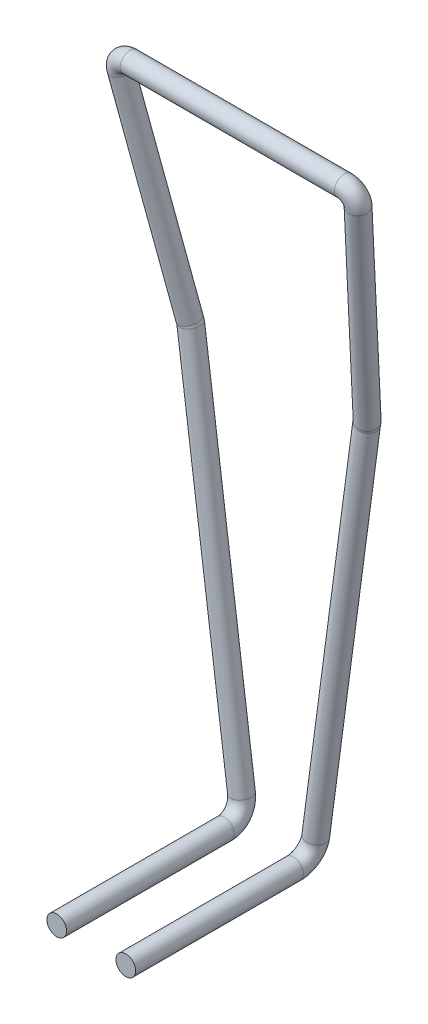
ISO-10303-21;
HEADER;
FILE_DESCRIPTION(('STEP AP214'),'2;1');
FILE_NAME('part.step','',(''),(''),'','','');
FILE_SCHEMA(('AUTOMOTIVE_DESIGN { 1 0 10303 214 1 1 1 1 }'));
ENDSEC;
DATA;
#1=APPLICATION_CONTEXT('core data for automotive mechanical design processes');
#2=APPLICATION_PROTOCOL_DEFINITION('international standard','automotive_design',2000,#1);
#3=PRODUCT_CONTEXT('',#1,'mechanical');
#4=PRODUCT('Part','Part','',(#3));
#5=PRODUCT_RELATED_PRODUCT_CATEGORY('part','',(#4));
#6=PRODUCT_DEFINITION_FORMATION('','',#4);
#7=PRODUCT_DEFINITION_CONTEXT('part definition',#1,'design');
#8=PRODUCT_DEFINITION('design','',#6,#7);
#9=PRODUCT_DEFINITION_SHAPE('','',#8);
#10=(LENGTH_UNIT() NAMED_UNIT(*) SI_UNIT(.MILLI.,.METRE.));
#11=(NAMED_UNIT(*) PLANE_ANGLE_UNIT() SI_UNIT($,.RADIAN.));
#12=(NAMED_UNIT(*) SI_UNIT($,.STERADIAN.) SOLID_ANGLE_UNIT());
#13=UNCERTAINTY_MEASURE_WITH_UNIT(LENGTH_MEASURE(1.E-05),#10,'distance_accuracy_value','');
#14=(GEOMETRIC_REPRESENTATION_CONTEXT(3) GLOBAL_UNCERTAINTY_ASSIGNED_CONTEXT((#13)) GLOBAL_UNIT_ASSIGNED_CONTEXT((#10,
#11,#12)) REPRESENTATION_CONTEXT('',''));
#15=CARTESIAN_POINT('',(0.,0.,0.));
#16=DIRECTION('',(0.,0.,1.));
#17=DIRECTION('',(1.,0.,0.));
#18=AXIS2_PLACEMENT_3D('',#15,#16,#17);
#19=CARTESIAN_POINT('',(0.350000000000152,-0.0999999999999992,0.100000000000001));
#20=DIRECTION('',(0.,0.,1.));
#21=DIRECTION('',(0.,-1.,0.));
#22=AXIS2_PLACEMENT_3D('',#19,#20,#21);
#23=CYLINDRICAL_SURFACE('',#22,0.1);
#24=CARTESIAN_POINT('',(0.350000000000152,-0.0999999999999992,0.100000000000001));
#25=DIRECTION('',(0.,0.,-1.));
#26=DIRECTION('',(-0.99127859616408,0.131782945736434,0.));
#27=AXIS2_PLACEMENT_3D('',#24,#25,#26);
#28=CIRCLE('',#27,0.1);
#29=CARTESIAN_POINT('',(0.336821705426508,-0.199127859616407,0.100000000000001));
#30=VERTEX_POINT('',#29);
#31=EDGE_CURVE('E99',#30,#30,#28,.T.);
#32=ORIENTED_EDGE('',*,*,#31,.F.);
#33=EDGE_LOOP('',(#32));
#34=FACE_BOUND('',#33,.T.);
#35=CARTESIAN_POINT('',(0.350000000000152,-0.0999999999999992,1.8));
#36=DIRECTION('',(0.,0.,-1.));
#37=DIRECTION('',(-0.99127859616408,0.131782945736434,0.));
#38=AXIS2_PLACEMENT_3D('',#35,#36,#37);
#39=CIRCLE('',#38,0.1);
#40=CARTESIAN_POINT('',(0.250872140383743,-0.0868217054263558,1.8));
#41=VERTEX_POINT('',#40);
#42=EDGE_CURVE('E12',#41,#41,#39,.T.);
#43=ORIENTED_EDGE('',*,*,#42,.T.);
#44=EDGE_LOOP('',(#43));
#45=FACE_BOUND('',#44,.T.);
#46=ADVANCED_FACE('F93',(#34,#45),#23,.T.);
#47=CARTESIAN_POINT('',(0.37624165591859,0.097391185137691,0.0999999999999995));
#48=DIRECTION('',(-0.99127859616408,0.131782945736434,0.));
#49=DIRECTION('',(-0.131782945736434,-0.99127859616408,0.));
#50=AXIS2_PLACEMENT_3D('',#47,#48,#49);
#51=TOROIDAL_SURFACE('',#50,0.199127859616387,0.1);
#52=CARTESIAN_POINT('',(0.37624165591859,0.0973911851376908,-0.0991278596163876));
#53=DIRECTION('',(0.131782945736436,0.991278596164079,0.));
#54=DIRECTION('',(-0.991278596164079,0.131782945736436,0.));
#55=AXIS2_PLACEMENT_3D('',#52,#53,#54);
#56=CIRCLE('',#55,0.1);
#57=CARTESIAN_POINT('',(0.37624165591859,0.0973911851376907,-0.199127859616388));
#58=VERTEX_POINT('',#57);
#59=EDGE_CURVE('E151',#58,#58,#56,.T.);
#60=CARTESIAN_POINT('',(0.37624165591859,0.097391185137691,0.0999999999999995));
#61=DIRECTION('',(-0.99127859616408,0.131782945736434,0.));
#62=DIRECTION('',(-0.131782945736434,-0.99127859616408,0.));
#63=AXIS2_PLACEMENT_3D('',#60,#61,#62);
#64=CIRCLE('',#63,0.299127859616387);
#65=EDGE_CURVE('',#58,#30,#64,.T.);
#66=ORIENTED_EDGE('',*,*,#59,.F.);
#67=ORIENTED_EDGE('',*,*,#31,.T.);
#68=ORIENTED_EDGE('',*,*,#65,.T.);
#69=ORIENTED_EDGE('',*,*,#65,.F.);
#70=EDGE_LOOP('',(#66,#68,#67,#69));
#71=FACE_BOUND('',#70,.T.);
#72=ADVANCED_FACE('F160',(#71),#51,.T.);
#73=CARTESIAN_POINT('',(1.20240864931992,6.24335833757032,0.298245940234091));
#74=DIRECTION('',(-0.131782945736434,-0.976218846897443,-0.172133721784126));
#75=DIRECTION('',(0.,0.173648177666931,-0.984807753012208));
#76=AXIS2_PLACEMENT_3D('',#73,#74,#75);
#77=CYLINDRICAL_SURFACE('',#76,0.1);
#78=CARTESIAN_POINT('',(1.20240864931992,6.24335833757032,0.298245940234091));
#79=DIRECTION('',(-0.131782945736443,-0.976218846897443,-0.172133721784116));
#80=DIRECTION('',(0.,-0.173648177666921,0.98480775301221));
#81=AXIS2_PLACEMENT_3D('',#78,#79,#80);
#82=CIRCLE('',#81,0.1);
#83=CARTESIAN_POINT('',(1.30153650893633,6.23038025090272,0.29595755339662));
#84=VERTEX_POINT('',#83);
#85=EDGE_CURVE('E103',#84,#84,#82,.T.);
#86=ORIENTED_EDGE('',*,*,#85,.T.);
#87=EDGE_LOOP('',(#86));
#88=FACE_BOUND('',#87,.T.);
#89=CARTESIAN_POINT('',(0.998853683453174,3.98818110698593,-0.0994496955048382));
#90=CARTESIAN_POINT('',(0.998761833545385,4.02292276402977,-0.296409104595756));
#91=CARTESIAN_POINT('',(0.802184878507584,4.06129860006108,-0.28954832188118));
#92=CARTESIAN_POINT('',(0.802276728415373,4.02655694301725,-0.0925889127902628));
#93=CARTESIAN_POINT('',(0.802368578323163,3.99181528597342,0.104370496300655));
#94=CARTESIAN_POINT('',(0.998945533360963,3.9534394499421,0.0975097135860795));
#95=CARTESIAN_POINT('',(0.998853683453174,3.98818110698593,-0.0994496955048382));
#96=(BOUNDED_CURVE() B_SPLINE_CURVE(3,(#89,#90,#91,#92,#93,#94,#95),.UNSPECIFIED.,.T.,
.F.) B_SPLINE_CURVE_WITH_KNOTS((4,3,4),(0.,0.5,1.),
.UNSPECIFIED.) CURVE() GEOMETRIC_REPRESENTATION_ITEM() RATIONAL_B_SPLINE_CURVE((1.,
0.333333333333333,0.333333333333333,1.,0.333333333333333,0.333333333333333,1.)) REPRESENTATION_ITEM(''));
#97=CARTESIAN_POINT('',(0.998853683453174,3.98818110698593,-0.0994496955048382));
#98=VERTEX_POINT('',#97);
#99=EDGE_CURVE('E143',#98,#98,#96,.T.);
#100=ORIENTED_EDGE('',*,*,#99,.T.);
#101=EDGE_LOOP('',(#100));
#102=FACE_BOUND('',#101,.T.);
#103=ADVANCED_FACE('F162',(#88,#102),#77,.T.);
#104=CARTESIAN_POINT('',(1.0858259474061,6.25862165925643,0.300937275662585));
#105=DIRECTION('',(0.,0.173648177666927,-0.984807753012209));
#106=DIRECTION('',(0.,0.984807753012209,0.173648177666927));
#107=AXIS2_PLACEMENT_3D('',#104,#105,#106);
#108=TOROIDAL_SURFACE('',#107,0.117608412372625,0.1);
#109=CARTESIAN_POINT('',(1.0858259474061,6.37444333558045,0.321359762149392));
#110=DIRECTION('',(1.,0.,0.));
#111=DIRECTION('',(0.,-0.173648177666926,0.984807753012209));
#112=AXIS2_PLACEMENT_3D('',#109,#110,#111);
#113=CIRCLE('',#112,0.1);
#114=CARTESIAN_POINT('',(1.0858259474061,6.47292411088167,0.338724579916085));
#115=VERTEX_POINT('',#114);
#116=EDGE_CURVE('E107',#115,#115,#113,.T.);
#117=CARTESIAN_POINT('',(1.0858259474061,6.25862165925643,0.300937275662585));
#118=DIRECTION('',(0.,0.173648177666927,-0.984807753012209));
#119=DIRECTION('',(0.,0.984807753012209,0.173648177666927));
#120=AXIS2_PLACEMENT_3D('',#117,#118,#119);
#121=CIRCLE('',#120,0.217608412372625);
#122=EDGE_CURVE('',#115,#84,#121,.T.);
#123=ORIENTED_EDGE('',*,*,#116,.T.);
#124=ORIENTED_EDGE('',*,*,#85,.F.);
#125=ORIENTED_EDGE('',*,*,#122,.T.);
#126=ORIENTED_EDGE('',*,*,#122,.F.);
#127=EDGE_LOOP('',(#123,#125,#124,#126));
#128=FACE_BOUND('',#127,.T.);
#129=ADVANCED_FACE('F167',(#128),#108,.T.);
#130=CARTESIAN_POINT('',(-1.0858259474061,6.37444333558045,0.321359762149392));
#131=DIRECTION('',(1.,0.,0.));
#132=DIRECTION('',(0.,1.,0.));
#133=AXIS2_PLACEMENT_3D('',#130,#131,#132);
#134=CYLINDRICAL_SURFACE('',#133,0.1);
#135=CARTESIAN_POINT('',(-1.0858259474061,6.37444333558045,0.321359762149392));
#136=DIRECTION('',(1.,0.,0.));
#137=DIRECTION('',(0.,-0.173648177666926,0.984807753012209));
#138=AXIS2_PLACEMENT_3D('',#135,#136,#137);
#139=CIRCLE('',#138,0.1);
#140=CARTESIAN_POINT('',(-1.0858259474061,6.47292411088168,0.338724579916085));
#141=VERTEX_POINT('',#140);
#142=EDGE_CURVE('E112',#141,#141,#139,.T.);
#143=ORIENTED_EDGE('',*,*,#142,.T.);
#144=EDGE_LOOP('',(#143));
#145=FACE_BOUND('',#144,.T.);
#146=ORIENTED_EDGE('',*,*,#116,.F.);
#147=EDGE_LOOP('',(#146));
#148=FACE_BOUND('',#147,.T.);
#149=ADVANCED_FACE('F174',(#145,#148),#134,.T.);
#150=CARTESIAN_POINT('',(-1.0858259474061,6.25862165925644,0.300937275662585));
#151=DIRECTION('',(0.,0.173648177666927,-0.984807753012209));
#152=DIRECTION('',(0.,0.984807753012209,0.173648177666927));
#153=AXIS2_PLACEMENT_3D('',#150,#151,#152);
#154=TOROIDAL_SURFACE('',#153,0.117608412372625,0.1);
#155=CARTESIAN_POINT('',(-1.20240864931992,6.24335833757033,0.298245940234091));
#156=DIRECTION('',(-0.131782945736431,0.976218846897443,0.172133721784128));
#157=DIRECTION('',(0.,-0.173648177666933,0.984807753012208));
#158=AXIS2_PLACEMENT_3D('',#155,#156,#157);
#159=CIRCLE('',#158,0.1);
#160=CARTESIAN_POINT('',(-1.30153650893633,6.23038025090272,0.29595755339662));
#161=VERTEX_POINT('',#160);
#162=EDGE_CURVE('E125',#161,#161,#159,.T.);
#163=CARTESIAN_POINT('',(-1.0858259474061,6.25862165925644,0.300937275662585));
#164=DIRECTION('',(0.,0.173648177666927,-0.984807753012209));
#165=DIRECTION('',(0.,0.984807753012209,0.173648177666927));
#166=AXIS2_PLACEMENT_3D('',#163,#164,#165);
#167=CIRCLE('',#166,0.217608412372625);
#168=EDGE_CURVE('',#161,#141,#167,.T.);
#169=ORIENTED_EDGE('',*,*,#162,.T.);
#170=ORIENTED_EDGE('',*,*,#142,.F.);
#171=ORIENTED_EDGE('',*,*,#168,.T.);
#172=ORIENTED_EDGE('',*,*,#168,.F.);
#173=EDGE_LOOP('',(#169,#171,#170,#172));
#174=FACE_BOUND('',#173,.T.);
#175=ADVANCED_FACE('F178',(#174),#154,.T.);
#176=CARTESIAN_POINT('',(-0.376241655918441,0.0973911851377086,-0.0991278596164078));
#177=DIRECTION('',(-0.131782945736434,0.991278596164079,0.));
#178=DIRECTION('',(-0.991278596164079,-0.131782945736434,0.));
#179=AXIS2_PLACEMENT_3D('',#176,#177,#178);
#180=CYLINDRICAL_SURFACE('',#179,0.1);
#181=CARTESIAN_POINT('',(-0.376241655918441,0.0973911851377086,-0.0991278596164078));
#182=DIRECTION('',(0.131782945736434,-0.99127859616408,0.));
#183=DIRECTION('',(0.982633255213028,0.130633613447978,-0.131782945736434));
#184=AXIS2_PLACEMENT_3D('',#181,#182,#183);
#185=CIRCLE('',#184,0.1);
#186=CARTESIAN_POINT('',(-0.376241655918441,0.0973911851377076,-0.199127859616408));
#187=VERTEX_POINT('',#186);
#188=EDGE_CURVE('E118',#187,#187,#185,.T.);
#189=ORIENTED_EDGE('',*,*,#188,.F.);
#190=EDGE_LOOP('',(#189));
#191=FACE_BOUND('',#190,.T.);
#192=CARTESIAN_POINT('',(-0.891571113557251,3.97372782699625,-0.0991278596164079));
#193=DIRECTION('',(-0.194526739257409,0.980897215230344,2.94488834351061E-05));
#194=DIRECTION('',(0.980897108163614,0.194526731905408,-0.000462353176904689));
#195=AXIS2_PLACEMENT_3D('',#192,#193,#194);
#196=ELLIPSE('',#195,0.100202637667993,0.1);
#197=CARTESIAN_POINT('',(-0.79328263603835,3.99321991863011,-0.0991741886242679));
#198=VERTEX_POINT('',#197);
#199=EDGE_CURVE('E115',#198,#198,#196,.T.);
#200=ORIENTED_EDGE('',*,*,#199,.F.);
#201=EDGE_LOOP('',(#200));
#202=FACE_BOUND('',#201,.T.);
#203=ADVANCED_FACE('F182',(#191,#202),#180,.T.);
#204=CARTESIAN_POINT('',(-0.376241655918441,0.0973911851377108,0.1));
#205=DIRECTION('',(0.99127859616408,0.131782945736434,0.));
#206=DIRECTION('',(-0.131782945736434,0.99127859616408,0.));
#207=AXIS2_PLACEMENT_3D('',#204,#205,#206);
#208=TOROIDAL_SURFACE('',#207,0.199127859616408,0.1);
#209=CARTESIAN_POINT('',(-0.35,-0.0999999999999998,0.1));
#210=DIRECTION('',(0.,0.,1.));
#211=DIRECTION('',(1.,0.,0.));
#212=AXIS2_PLACEMENT_3D('',#209,#210,#211);
#213=CIRCLE('',#212,0.1);
#214=CARTESIAN_POINT('',(-0.336821705426357,-0.199127859616408,0.1));
#215=VERTEX_POINT('',#214);
#216=EDGE_CURVE('E121',#215,#215,#213,.T.);
#217=CARTESIAN_POINT('',(-0.376241655918441,0.0973911851377108,0.1));
#218=DIRECTION('',(0.99127859616408,0.131782945736434,0.));
#219=DIRECTION('',(-0.131782945736434,0.99127859616408,0.));
#220=AXIS2_PLACEMENT_3D('',#217,#218,#219);
#221=CIRCLE('',#220,0.299127859616408);
#222=EDGE_CURVE('',#215,#187,#221,.T.);
#223=ORIENTED_EDGE('',*,*,#216,.F.);
#224=ORIENTED_EDGE('',*,*,#188,.T.);
#225=ORIENTED_EDGE('',*,*,#222,.T.);
#226=ORIENTED_EDGE('',*,*,#222,.F.);
#227=EDGE_LOOP('',(#223,#225,#224,#226));
#228=FACE_BOUND('',#227,.T.);
#229=ADVANCED_FACE('F186',(#228),#208,.T.);
#230=CARTESIAN_POINT('',(-0.35,-0.0999999999999998,0.1));
#231=DIRECTION('',(0.,0.,1.));
#232=DIRECTION('',(0.,-1.,0.));
#233=AXIS2_PLACEMENT_3D('',#230,#231,#232);
#234=CYLINDRICAL_SURFACE('',#233,0.1);
#235=ORIENTED_EDGE('',*,*,#216,.T.);
#236=EDGE_LOOP('',(#235));
#237=FACE_BOUND('',#236,.T.);
#238=CARTESIAN_POINT('',(-0.35,-0.1,1.8));
#239=DIRECTION('',(0.,0.,1.));
#240=DIRECTION('',(1.,0.,0.));
#241=AXIS2_PLACEMENT_3D('',#238,#239,#240);
#242=CIRCLE('',#241,0.1);
#243=CARTESIAN_POINT('',(-0.25,-0.1,1.8));
#244=VERTEX_POINT('',#243);
#245=EDGE_CURVE('E122',#244,#244,#242,.T.);
#246=ORIENTED_EDGE('',*,*,#245,.F.);
#247=EDGE_LOOP('',(#246));
#248=FACE_BOUND('',#247,.T.);
#249=ADVANCED_FACE('F190',(#237,#248),#234,.T.);
#250=CARTESIAN_POINT('',(-0.35,-0.1,1.8));
#251=DIRECTION('',(0.,0.,1.));
#252=DIRECTION('',(1.,0.,0.));
#253=AXIS2_PLACEMENT_3D('',#250,#251,#252);
#254=PLANE('',#253);
#255=ORIENTED_EDGE('',*,*,#245,.T.);
#256=EDGE_LOOP('',(#255));
#257=FACE_BOUND('',#256,.T.);
#258=ADVANCED_FACE('F194',(#257),#254,.T.);
#259=CARTESIAN_POINT('',(-0.793282636038349,3.9932199186301,-0.0991741886242679));
#260=CARTESIAN_POINT('',(-0.794948564272785,3.99947101103212,-0.0988418047525957));
#261=CARTESIAN_POINT('',(-0.7980101730222,4.01106235800287,-0.0993206987485209));
#262=CARTESIAN_POINT('',(-0.801049718369058,4.02235544232636,-0.0978038724099919));
#263=CARTESIAN_POINT('',(-0.802375980939512,4.02731999103552,-0.0971000125676045));
#264=CARTESIAN_POINT('',(-0.793374485946095,3.99320770788384,-0.299174167160497));
#265=CARTESIAN_POINT('',(-0.794993691652819,3.99923489514231,-0.298251211246527));
#266=CARTESIAN_POINT('',(-0.802487882393619,4.02757086013121,-0.299270640378896));
#267=CARTESIAN_POINT('',(-0.810002440721565,4.05553876922169,-0.295315012521435));
#268=CARTESIAN_POINT('',(-0.811277746622648,4.06027019487814,-0.294166959416065));
#269=CARTESIAN_POINT('',(-0.989951440983896,3.95422352461613,-0.299081509144777));
#270=CARTESIAN_POINT('',(-0.99157064669062,3.9602507118746,-0.298158553230807));
#271=CARTESIAN_POINT('',(-0.998990099591712,3.98821766296417,-0.298099299472849));
#272=CARTESIAN_POINT('',(-1.00638145985243,4.01564105322673,-0.293152852273927));
#273=CARTESIAN_POINT('',(-1.00765676575351,4.02037247888317,-0.292004799168557));
#274=CARTESIAN_POINT('',(-0.98985959107615,3.95423573536239,-0.0990815306085479));
#275=CARTESIAN_POINT('',(-0.99150215804673,3.96037487519263,-0.0984538607157266));
#276=CARTESIAN_POINT('',(-0.994505423256666,3.97167928723967,-0.0981247271416645));
#277=CARTESIAN_POINT('',(-0.997454215834608,3.98257428785775,-0.0958638087939746));
#278=CARTESIAN_POINT('',(-0.998755000070377,3.98742227504055,-0.0949378523200959));
#279=CARTESIAN_POINT('',(-0.989767741168404,3.95424794610865,0.100918447927681));
#280=CARTESIAN_POINT('',(-0.99143366940284,3.96049903851067,0.101250831799354));
#281=CARTESIAN_POINT('',(-0.990020746921619,3.95514091151517,0.101849845189521));
#282=CARTESIAN_POINT('',(-0.988526971816787,3.94950752248878,0.101425234685978));
#283=CARTESIAN_POINT('',(-0.989853234387241,3.95447207119793,0.102129094528365));
#284=CARTESIAN_POINT('',(-0.793190786130602,3.99323212937636,0.100825789911961));
#285=CARTESIAN_POINT('',(-0.794903436892752,3.99970712692193,0.100567601741336));
#286=CARTESIAN_POINT('',(-0.793532463650782,3.99455385587454,0.100629242881853));
#287=CARTESIAN_POINT('',(-0.792096996016553,3.98917211543103,0.0997072677014521));
#288=CARTESIAN_POINT('',(-0.793474215256376,3.9943697871929,0.0999669342808566));
#289=CARTESIAN_POINT('',(-0.793282636038349,3.9932199186301,-0.0991741886242679));
#290=CARTESIAN_POINT('',(-0.794948564272785,3.99947101103212,-0.0988418047525957));
#291=CARTESIAN_POINT('',(-0.7980101730222,4.01106235800287,-0.0993206987485209));
#292=CARTESIAN_POINT('',(-0.801049718369058,4.02235544232636,-0.0978038724099919));
#293=CARTESIAN_POINT('',(-0.802375980939512,4.02731999103552,-0.0971000125676045));
#294=(BOUNDED_SURFACE() B_SPLINE_SURFACE(3,3,((#259,#260,#261,#262,#263),(#264,#265,#266,#267,
#268),(#269,#270,#271,#272,#273),(#274,#275,#276,#277,#278),(#279,#280,#281,#282,#283),(#284,
#285,#286,#287,#288),(#289,#290,#291,#292,#293)),.UNSPECIFIED.,.T.,.F.,
.F.) B_SPLINE_SURFACE_WITH_KNOTS((4,3,4),(4,1,4),(0.,0.5,1.),(0.,0.559331190816291,1.),
.UNSPECIFIED.) GEOMETRIC_REPRESENTATION_ITEM() RATIONAL_B_SPLINE_SURFACE(((1.,1.,1.,1.,1.),
(0.333333333333333,0.333333333333333,0.333333333333333,0.333333333333333,0.333333333333333),
(0.333333333333333,0.333333333333333,0.333333333333333,0.333333333333333,0.333333333333333),(1.,
1.,1.,1.,1.),(0.333333333333333,0.333333333333333,0.333333333333333,0.333333333333333,
0.333333333333333),(0.333333333333333,0.333333333333333,0.333333333333333,0.333333333333333,
0.333333333333333),(1.,1.,1.,1.,1.))) REPRESENTATION_ITEM('') SURFACE());
#295=CARTESIAN_POINT('',(-0.802375980939511,4.02731999103551,-0.0971000125676054));
#296=CARTESIAN_POINT('',(-0.793474215256375,3.99436978719289,0.0999669342808556));
#297=CARTESIAN_POINT('',(-0.98985323438724,3.95447207119792,0.102129094528364));
#298=CARTESIAN_POINT('',(-0.998755000070376,3.98742227504054,-0.0949378523200966));
#299=CARTESIAN_POINT('',(-1.00765676575351,4.02037247888316,-0.292004799168558));
#300=CARTESIAN_POINT('',(-0.811277746622648,4.06027019487813,-0.294166959416066));
#301=CARTESIAN_POINT('',(-0.802375980939511,4.02731999103551,-0.0971000125676054));
#302=(BOUNDED_CURVE() B_SPLINE_CURVE(3,(#295,#296,#297,#298,#299,#300,#301),.UNSPECIFIED.,.T.,
.F.) B_SPLINE_CURVE_WITH_KNOTS((4,3,4),(0.,0.5,1.),
.UNSPECIFIED.) CURVE() GEOMETRIC_REPRESENTATION_ITEM() RATIONAL_B_SPLINE_CURVE((1.,
0.333333333333333,0.333333333333333,1.,0.333333333333333,0.333333333333333,1.)) REPRESENTATION_ITEM(''));
#303=CARTESIAN_POINT('',(-0.802375980939511,4.02731999103551,-0.0971000125676054));
#304=VERTEX_POINT('',#303);
#305=EDGE_CURVE('E130',#304,#304,#302,.T.);
#306=ORIENTED_EDGE('',*,*,#199,.T.);
#307=EDGE_LOOP('',(#306));
#308=FACE_BOUND('',#307,.T.);
#309=ORIENTED_EDGE('',*,*,#305,.T.);
#310=EDGE_LOOP('',(#309));
#311=FACE_BOUND('',#310,.T.);
#312=ADVANCED_FACE('F198',(#308,#311),#294,.T.);
#313=CARTESIAN_POINT('',(-0.802375980939511,4.02731999103551,-0.0971000125676054));
#314=CARTESIAN_POINT('',(-1.10338249490243,6.25710951598056,0.296072041981318));
#315=CARTESIAN_POINT('',(-0.793474215256375,3.99436978719289,0.0999669342808556));
#316=CARTESIAN_POINT('',(-1.0944040109739,6.22359100038382,0.493038780134074));
#317=CARTESIAN_POINT('',(-0.98985323438724,3.95447207119792,0.102129094528364));
#318=CARTESIAN_POINT('',(-1.29245631980888,6.19608864356335,0.49738657663962));
#319=CARTESIAN_POINT('',(-0.998755000070376,3.98742227504054,-0.0949378523200966));
#320=CARTESIAN_POINT('',(-1.30143480373741,6.22960715916009,0.300419838486864));
#321=CARTESIAN_POINT('',(-1.00765676575351,4.02037247888316,-0.292004799168558));
#322=CARTESIAN_POINT('',(-1.31041328766594,6.26312567475684,0.103453100334109));
#323=CARTESIAN_POINT('',(-0.811277746622648,4.06027019487813,-0.294166959416066));
#324=CARTESIAN_POINT('',(-1.11236097883096,6.2906280315773,0.099105303828563));
#325=CARTESIAN_POINT('',(-0.802375980939511,4.02731999103551,-0.0971000125676054));
#326=CARTESIAN_POINT('',(-1.10338249490243,6.25710951598056,0.296072041981318));
#327=(BOUNDED_SURFACE() B_SPLINE_SURFACE(3,1,((#313,#314),(#315,#316),(#317,#318),(#319,#320),
(#321,#322),(#323,#324),(#325,#326)),.UNSPECIFIED.,.T.,.F.,.F.) B_SPLINE_SURFACE_WITH_KNOTS((4,
3,4),(2,2),(0.,0.5,1.),(0.,1.),
.UNSPECIFIED.) GEOMETRIC_REPRESENTATION_ITEM() RATIONAL_B_SPLINE_SURFACE(((1.,1.),
(0.333333333333333,0.333333333333333),(0.333333333333333,0.333333333333333),(1.,1.),
(0.333333333333333,0.333333333333333),(0.333333333333333,0.333333333333333),(1.,1.))) REPRESENTATION_ITEM('') SURFACE());
#328=ORIENTED_EDGE('',*,*,#305,.F.);
#329=EDGE_LOOP('',(#328));
#330=FACE_BOUND('',#329,.T.);
#331=ORIENTED_EDGE('',*,*,#162,.F.);
#332=EDGE_LOOP('',(#331));
#333=FACE_BOUND('',#332,.T.);
#334=ADVANCED_FACE('F204',(#330,#333),#327,.F.);
#335=CARTESIAN_POINT('',(0.998853683453174,3.98818110698593,-0.0994496955048382));
#336=CARTESIAN_POINT('',(0.997188656376083,3.98197639740456,-0.100268843923116));
#337=CARTESIAN_POINT('',(0.994129276427596,3.97066273586454,-0.102862275115137));
#338=CARTESIAN_POINT('',(0.991087792037484,3.95928140856322,-0.103439283938307));
#339=CARTESIAN_POINT('',(0.989760907693509,3.95427190512628,-0.103656598541557));
#340=CARTESIAN_POINT('',(0.998761833545385,4.02292276402977,-0.296409104595756));
#341=CARTESIAN_POINT('',(0.997143528996004,4.01683600621076,-0.296607772367925));
#342=CARTESIAN_POINT('',(0.989651396636137,3.98912534133554,-0.302641267692259));
#343=CARTESIAN_POINT('',(0.982135069685238,3.96089966051517,-0.303712010270504));
#344=CARTESIAN_POINT('',(0.980859142010629,3.9560426051173,-0.303451398511403));
#345=CARTESIAN_POINT('',(0.802184878507584,4.06129860006108,-0.28954832188118));
#346=CARTESIAN_POINT('',(0.800566573958203,4.05521184224207,-0.28974698965335));
#347=CARTESIAN_POINT('',(0.793149183332754,4.02767728455535,-0.294654069236737));
#348=CARTESIAN_POINT('',(0.785756050554361,3.99981578536769,-0.294654532420164));
#349=CARTESIAN_POINT('',(0.784480122879752,3.99495872996982,-0.294393920661063));
#350=CARTESIAN_POINT('',(0.802276728415373,4.02655694301725,-0.0925889127902628));
#351=CARTESIAN_POINT('',(0.800635062602137,4.02041120931706,-0.0930978208854866));
#352=CARTESIAN_POINT('',(0.797634029117554,4.00923981901877,-0.0948456431323064));
#353=CARTESIAN_POINT('',(0.794683294571924,3.9981213093962,-0.0946207692691427));
#354=CARTESIAN_POINT('',(0.793381888562632,3.9931880299788,-0.0945991206912171));
#355=CARTESIAN_POINT('',(0.802368578323163,3.99181528597342,0.104370496300655));
#356=CARTESIAN_POINT('',(0.800703551246072,3.98561057639204,0.103551347882377));
#357=CARTESIAN_POINT('',(0.802118874902354,3.99080235348219,0.104962782972125));
#358=CARTESIAN_POINT('',(0.803610538589487,3.99642683342472,0.105412993881879));
#359=CARTESIAN_POINT('',(0.802283654245513,3.99141732998777,0.105195679278629));
#360=CARTESIAN_POINT('',(0.998945533360963,3.9534394499421,0.0975097135860795));
#361=CARTESIAN_POINT('',(0.997233783756162,3.94711678859836,0.0960700845216924));
#362=CARTESIAN_POINT('',(0.998607156219055,3.95220013039355,0.0969167174619846));
#363=CARTESIAN_POINT('',(1.00004051438973,3.95766315661128,0.0968334423938908));
#364=CARTESIAN_POINT('',(0.998662673376389,3.95250120513525,0.0961382014282892));
#365=CARTESIAN_POINT('',(0.998853683453174,3.98818110698593,-0.0994496955048382));
#366=CARTESIAN_POINT('',(0.997188656376083,3.98197639740456,-0.100268843923116));
#367=CARTESIAN_POINT('',(0.994129276427596,3.97066273586454,-0.102862275115137));
#368=CARTESIAN_POINT('',(0.991087792037484,3.95928140856322,-0.103439283938307));
#369=CARTESIAN_POINT('',(0.989760907693509,3.95427190512628,-0.103656598541557));
#370=(BOUNDED_SURFACE() B_SPLINE_SURFACE(3,3,((#335,#336,#337,#338,#339),(#340,#341,#342,#343,
#344),(#345,#346,#347,#348,#349),(#350,#351,#352,#353,#354),(#355,#356,#357,#358,#359),(#360,
#361,#362,#363,#364),(#365,#366,#367,#368,#369)),.UNSPECIFIED.,.T.,.F.,
.F.) B_SPLINE_SURFACE_WITH_KNOTS((4,3,4),(4,1,4),(0.,0.5,1.),(0.,0.559321764812687,1.),
.UNSPECIFIED.) GEOMETRIC_REPRESENTATION_ITEM() RATIONAL_B_SPLINE_SURFACE(((1.,1.,1.,1.,1.),
(0.333333333333333,0.333333333333333,0.333333333333333,0.333333333333333,0.333333333333333),
(0.333333333333333,0.333333333333333,0.333333333333333,0.333333333333333,0.333333333333333),(1.,
1.,1.,1.,1.),(0.333333333333333,0.333333333333333,0.333333333333333,0.333333333333333,
0.333333333333333),(0.333333333333333,0.333333333333333,0.333333333333333,0.333333333333333,
0.333333333333333),(1.,1.,1.,1.,1.))) REPRESENTATION_ITEM('') SURFACE());
#371=CARTESIAN_POINT('',(0.989760907693509,3.95427190512628,-0.103656598541557));
#372=CARTESIAN_POINT('',(0.980859142010629,3.9560426051173,-0.303451398511403));
#373=CARTESIAN_POINT('',(0.784480122879752,3.99495872996982,-0.294393920661063));
#374=CARTESIAN_POINT('',(0.793381888562632,3.9931880299788,-0.0945991206912171));
#375=CARTESIAN_POINT('',(0.802283654245513,3.99141732998777,0.105195679278629));
#376=CARTESIAN_POINT('',(0.998662673376389,3.95250120513525,0.0961382014282892));
#377=CARTESIAN_POINT('',(0.989760907693509,3.95427190512628,-0.103656598541557));
#378=(BOUNDED_CURVE() B_SPLINE_CURVE(3,(#371,#372,#373,#374,#375,#376,#377),.UNSPECIFIED.,.T.,
.F.) B_SPLINE_CURVE_WITH_KNOTS((4,3,4),(0.,0.5,1.),
.UNSPECIFIED.) CURVE() GEOMETRIC_REPRESENTATION_ITEM() RATIONAL_B_SPLINE_CURVE((1.,
0.333333333333333,0.333333333333333,1.,0.333333333333333,0.333333333333333,1.)) REPRESENTATION_ITEM(''));
#379=CARTESIAN_POINT('',(0.989760907693509,3.95427190512628,-0.103656598541557));
#380=VERTEX_POINT('',#379);
#381=EDGE_CURVE('E135',#380,#380,#378,.F.);
#382=ORIENTED_EDGE('',*,*,#99,.F.);
#383=EDGE_LOOP('',(#382));
#384=FACE_BOUND('',#383,.T.);
#385=ORIENTED_EDGE('',*,*,#381,.F.);
#386=EDGE_LOOP('',(#385));
#387=FACE_BOUND('',#386,.T.);
#388=ADVANCED_FACE('F215',(#384,#387),#370,.F.);
#389=CARTESIAN_POINT('',(0.251570656138686,-0.0823459843944391,1.8));
#390=DIRECTION('',(0.,0.,-1.));
#391=DIRECTION('',(-0.99127859616408,0.131782945736434,0.));
#392=AXIS2_PLACEMENT_3D('',#389,#390,#391);
#393=PLANE('',#392);
#394=ORIENTED_EDGE('',*,*,#42,.F.);
#395=EDGE_LOOP('',(#394));
#396=FACE_BOUND('',#395,.T.);
#397=ADVANCED_FACE('F226',(#396),#393,.F.);
#398=CARTESIAN_POINT('',(0.989760907693509,3.95427190512628,-0.103656598541557));
#399=CARTESIAN_POINT('',(0.475267810336086,0.0842264114962669,-0.103656598541558));
#400=CARTESIAN_POINT('',(0.998662673376389,3.95250120513525,0.0961382014282892));
#401=CARTESIAN_POINT('',(0.484246294264358,0.0830327903842062,0.0961382014282887));
#402=CARTESIAN_POINT('',(0.802283654245513,3.99141732998777,0.105195679278629));
#403=CARTESIAN_POINT('',(0.286193985429366,0.109362337667054,0.105195679278629));
#404=CARTESIAN_POINT('',(0.793381888562633,3.9931880299788,-0.0945991206912171));
#405=CARTESIAN_POINT('',(0.277215501501094,0.110555958779115,-0.0945991206912176));
#406=CARTESIAN_POINT('',(0.784480122879753,3.99495872996983,-0.294393920661063));
#407=CARTESIAN_POINT('',(0.268237017572822,0.111749579891176,-0.294393920661064));
#408=CARTESIAN_POINT('',(0.980859142010629,3.95604260511731,-0.303451398511403));
#409=CARTESIAN_POINT('',(0.466289326407814,0.085420032608327,-0.303451398511404));
#410=CARTESIAN_POINT('',(0.989760907693509,3.95427190512628,-0.103656598541557));
#411=CARTESIAN_POINT('',(0.475267810336086,0.0842264114962669,-0.103656598541558));
#412=(BOUNDED_SURFACE() B_SPLINE_SURFACE(3,1,((#398,#399),(#400,#401),(#402,#403),(#404,#405),
(#406,#407),(#408,#409),(#410,#411)),.UNSPECIFIED.,.T.,.F.,.F.) B_SPLINE_SURFACE_WITH_KNOTS((4,
3,4),(2,2),(0.,0.5,1.),(0.,1.),
.UNSPECIFIED.) GEOMETRIC_REPRESENTATION_ITEM() RATIONAL_B_SPLINE_SURFACE(((1.,1.),
(0.333333333333333,0.333333333333333),(0.333333333333333,0.333333333333333),(1.,1.),
(0.333333333333333,0.333333333333333),(0.333333333333333,0.333333333333333),(1.,1.))) REPRESENTATION_ITEM('') SURFACE());
#413=ORIENTED_EDGE('',*,*,#381,.T.);
#414=EDGE_LOOP('',(#413));
#415=FACE_BOUND('',#414,.T.);
#416=ORIENTED_EDGE('',*,*,#59,.T.);
#417=EDGE_LOOP('',(#416));
#418=FACE_BOUND('',#417,.T.);
#419=ADVANCED_FACE('F158',(#415,#418),#412,.T.);
#420=CLOSED_SHELL('',(#46,#72,#103,#129,#149,#175,#203,#229,#249,#258,#312,#334,#388,#397,#419));
#421=MANIFOLD_SOLID_BREP('B2',#420);
#422=ADVANCED_BREP_SHAPE_REPRESENTATION('',(#18,#421),#14);
#423=SHAPE_DEFINITION_REPRESENTATION(#9,#422);
ENDSEC;
END-ISO-10303-21;
